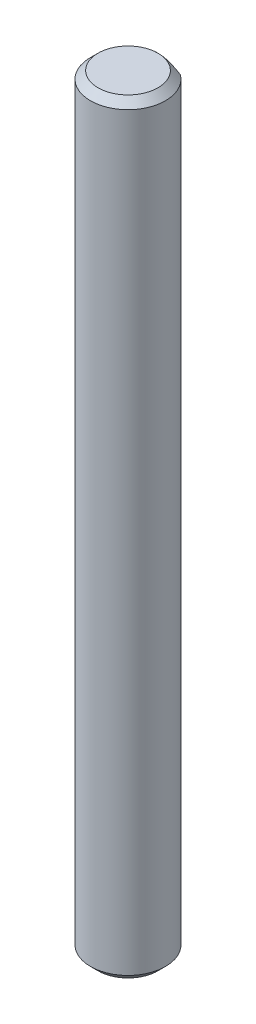
ISO-10303-21;
HEADER;
FILE_DESCRIPTION(('STEP AP214'),'2;1');
FILE_NAME('part.step','',(''),(''),'','','');
FILE_SCHEMA(('AUTOMOTIVE_DESIGN { 1 0 10303 214 1 1 1 1 }'));
ENDSEC;
DATA;
#1=APPLICATION_CONTEXT('core data for automotive mechanical design processes');
#2=APPLICATION_PROTOCOL_DEFINITION('international standard','automotive_design',2000,#1);
#3=PRODUCT_CONTEXT('',#1,'mechanical');
#4=PRODUCT('Part','Part','',(#3));
#5=PRODUCT_RELATED_PRODUCT_CATEGORY('part','',(#4));
#6=PRODUCT_DEFINITION_FORMATION('','',#4);
#7=PRODUCT_DEFINITION_CONTEXT('part definition',#1,'design');
#8=PRODUCT_DEFINITION('design','',#6,#7);
#9=PRODUCT_DEFINITION_SHAPE('','',#8);
#10=(LENGTH_UNIT() NAMED_UNIT(*) SI_UNIT(.MILLI.,.METRE.));
#11=(NAMED_UNIT(*) PLANE_ANGLE_UNIT() SI_UNIT($,.RADIAN.));
#12=(NAMED_UNIT(*) SI_UNIT($,.STERADIAN.) SOLID_ANGLE_UNIT());
#13=UNCERTAINTY_MEASURE_WITH_UNIT(LENGTH_MEASURE(1.E-05),#10,'distance_accuracy_value','');
#14=(GEOMETRIC_REPRESENTATION_CONTEXT(3) GLOBAL_UNCERTAINTY_ASSIGNED_CONTEXT((#13)) GLOBAL_UNIT_ASSIGNED_CONTEXT((#10,
#11,#12)) REPRESENTATION_CONTEXT('',''));
#15=CARTESIAN_POINT('',(0.,0.,0.));
#16=DIRECTION('',(0.,0.,1.));
#17=DIRECTION('',(1.,0.,0.));
#18=AXIS2_PLACEMENT_3D('',#15,#16,#17);
#19=CARTESIAN_POINT('',(0.,51.,0.));
#20=DIRECTION('',(0.,-1.,0.));
#21=DIRECTION('',(0.,0.,-1.));
#22=AXIS2_PLACEMENT_3D('',#19,#20,#21);
#23=CYLINDRICAL_SURFACE('',#22,2.5);
#24=CARTESIAN_POINT('',(0.,0.499999999999994,0.));
#25=DIRECTION('',(0.,1.,0.));
#26=DIRECTION('',(0.,0.,1.));
#27=AXIS2_PLACEMENT_3D('',#24,#25,#26);
#28=CIRCLE('',#27,2.5);
#29=CARTESIAN_POINT('',(0.,0.499999999999994,2.5));
#30=VERTEX_POINT('',#29);
#31=EDGE_CURVE('E86',#30,#30,#28,.T.);
#32=ORIENTED_EDGE('',*,*,#31,.T.);
#33=EDGE_LOOP('',(#32));
#34=FACE_BOUND('',#33,.T.);
#35=DIRECTION('',(0.,1.,0.));
#36=VECTOR('',#35,1.);
#37=CARTESIAN_POINT('',(1.5,36.,-2.));
#38=LINE('',#37,#36);
#39=CARTESIAN_POINT('',(1.5,36.,-2.));
#40=VERTEX_POINT('',#39);
#41=CARTESIAN_POINT('',(1.5,50.5,-2.));
#42=VERTEX_POINT('',#41);
#43=EDGE_CURVE('E79',#40,#42,#38,.T.);
#44=ORIENTED_EDGE('',*,*,#43,.T.);
#45=CARTESIAN_POINT('',(0.,50.5,0.));
#46=DIRECTION('',(0.,1.,0.));
#47=DIRECTION('',(0.,0.,1.));
#48=AXIS2_PLACEMENT_3D('',#45,#46,#47);
#49=CIRCLE('',#48,2.5);
#50=CARTESIAN_POINT('',(-1.5,50.5,-2.));
#51=VERTEX_POINT('',#50);
#52=EDGE_CURVE('E81',#42,#51,#49,.F.);
#53=ORIENTED_EDGE('',*,*,#52,.T.);
#54=DIRECTION('',(0.,1.,0.));
#55=VECTOR('',#54,1.);
#56=CARTESIAN_POINT('',(-1.5,36.,-2.));
#57=LINE('',#56,#55);
#58=CARTESIAN_POINT('',(-1.5,36.,-2.));
#59=VERTEX_POINT('',#58);
#60=EDGE_CURVE('E77',#59,#51,#57,.T.);
#61=ORIENTED_EDGE('',*,*,#60,.F.);
#62=CARTESIAN_POINT('',(0.,36.,0.));
#63=DIRECTION('',(0.,1.,0.));
#64=DIRECTION('',(0.,0.,1.));
#65=AXIS2_PLACEMENT_3D('',#62,#63,#64);
#66=CIRCLE('',#65,2.5);
#67=EDGE_CURVE('E68',#40,#59,#66,.T.);
#68=ORIENTED_EDGE('',*,*,#67,.F.);
#69=EDGE_LOOP('',(#44,#53,#61,#68));
#70=FACE_BOUND('',#69,.T.);
#71=ADVANCED_FACE('F34',(#34,#70),#23,.T.);
#72=CARTESIAN_POINT('',(0.,51.,0.));
#73=DIRECTION('',(0.,1.,0.));
#74=DIRECTION('',(0.,0.,1.));
#75=AXIS2_PLACEMENT_3D('',#72,#73,#74);
#76=PLANE('',#75);
#77=CARTESIAN_POINT('',(0.,51.,0.));
#78=DIRECTION('',(0.,1.,0.));
#79=DIRECTION('',(0.,0.,1.));
#80=AXIS2_PLACEMENT_3D('',#77,#78,#79);
#81=CIRCLE('',#80,1.99999999999999);
#82=CARTESIAN_POINT('',(0.,51.,-2.));
#83=VERTEX_POINT('',#82);
#84=EDGE_CURVE('E92',#83,#83,#81,.T.);
#85=ORIENTED_EDGE('',*,*,#84,.T.);
#86=EDGE_LOOP('',(#85));
#87=FACE_BOUND('',#86,.T.);
#88=ADVANCED_FACE('F102',(#87),#76,.T.);
#89=CARTESIAN_POINT('',(0.,0.,0.));
#90=DIRECTION('',(0.,1.,0.));
#91=DIRECTION('',(0.,0.,1.));
#92=AXIS2_PLACEMENT_3D('',#89,#90,#91);
#93=PLANE('',#92);
#94=CARTESIAN_POINT('',(0.,0.,0.));
#95=DIRECTION('',(0.,1.,0.));
#96=DIRECTION('',(0.,0.,1.));
#97=AXIS2_PLACEMENT_3D('',#94,#95,#96);
#98=CIRCLE('',#97,1.99999999999999);
#99=CARTESIAN_POINT('',(0.,0.,1.99999999999999));
#100=VERTEX_POINT('',#99);
#101=EDGE_CURVE('E89',#100,#100,#98,.F.);
#102=ORIENTED_EDGE('',*,*,#101,.T.);
#103=EDGE_LOOP('',(#102));
#104=FACE_BOUND('',#103,.T.);
#105=ADVANCED_FACE('F101',(#104),#93,.F.);
#106=CARTESIAN_POINT('',(-1.5,36.,-2.));
#107=DIRECTION('',(0.,0.,1.));
#108=DIRECTION('',(1.,0.,0.));
#109=AXIS2_PLACEMENT_3D('',#106,#107,#108);
#110=PLANE('',#109);
#111=CARTESIAN_POINT('',(-1.5,50.5,-2.));
#112=CARTESIAN_POINT('',(-1.42763018659214,50.5433736980276,-2.));
#113=CARTESIAN_POINT('',(-1.35436226532258,50.5853687019536,-2.));
#114=CARTESIAN_POINT('',(-1.20549660628809,50.6656443583189,-2.));
#115=CARTESIAN_POINT('',(-1.12989157710705,50.7039114197061,-2.));
#116=CARTESIAN_POINT('',(-0.978296734874827,50.774534191742,-2.));
#117=CARTESIAN_POINT('',(-0.902366736266404,50.8070165390548,-2.));
#118=CARTESIAN_POINT('',(-0.748220644904071,50.8658090166989,-2.));
#119=CARTESIAN_POINT('',(-0.670007876047703,50.8921276624893,-2.));
#120=CARTESIAN_POINT('',(-0.543060600019242,50.9280861032667,-2.));
#121=CARTESIAN_POINT('',(-0.495021163503639,50.9401901027996,-2.));
#122=CARTESIAN_POINT('',(-0.398260419217579,50.9612794306282,-2.));
#123=CARTESIAN_POINT('',(-0.349539198139852,50.9702651517484,-2.));
#124=CARTESIAN_POINT('',(-0.250852177401956,50.984927124024,-2.));
#125=CARTESIAN_POINT('',(-0.200878654038627,50.9905520018212,-2.));
#126=CARTESIAN_POINT('',(-0.100607619276169,50.9981023484678,-2.));
#127=CARTESIAN_POINT('',(-0.0503098472705245,51.0000243314446,-2.));
#128=CARTESIAN_POINT('',(0.,51.,-2.));
#129=B_SPLINE_CURVE_WITH_KNOTS('',3,(#111,#112,#113,#114,#115,#116,#117,#118,#119,#120,#121,
#122,#123,#124,#125,#126,#127,#128),.UNSPECIFIED.,.F.,.F.,(4,2,2,2,2,2,2,2,4),(0.,
0.2531950346956,0.50728107597429,0.754837752612878,1.00205037282501,1.15058504578388,
1.29910100031797,1.44983263801686,1.600706103947),.UNSPECIFIED.);
#130=EDGE_CURVE('E47',#51,#83,#129,.T.);
#131=ORIENTED_EDGE('',*,*,#130,.T.);
#132=CARTESIAN_POINT('',(0.,51.,-1.99999999999999));
#133=CARTESIAN_POINT('',(0.0614966481035616,51.0000514930087,-2.));
#134=CARTESIAN_POINT('',(0.122961796118779,50.997164788165,-2.));
#135=CARTESIAN_POINT('',(0.245274670057057,50.9859212389057,-2.));
#136=CARTESIAN_POINT('',(0.306123362775477,50.9775750221521,-2.));
#137=CARTESIAN_POINT('',(0.425885509906891,50.9559969816614,-2.));
#138=CARTESIAN_POINT('',(0.484814317272308,50.9428488248966,-2.));
#139=CARTESIAN_POINT('',(0.601555526074533,50.9122507618696,-2.));
#140=CARTESIAN_POINT('',(0.659367456410754,50.8947990813251,-2.));
#141=CARTESIAN_POINT('',(0.784576263433312,50.8525702057821,-2.));
#142=CARTESIAN_POINT('',(0.851714510760655,50.8270315815753,-2.));
#143=CARTESIAN_POINT('',(0.984250024576912,50.7717452055524,-2.));
#144=CARTESIAN_POINT('',(1.04964642506795,50.7419954048129,-2.));
#145=CARTESIAN_POINT('',(1.18016546542206,50.6784785026746,-2.));
#146=CARTESIAN_POINT('',(1.24525271545219,50.6446394298057,-2.));
#147=CARTESIAN_POINT('',(1.37378197006118,50.5742160914667,-2.));
#148=CARTESIAN_POINT('',(1.43722666174302,50.5376367483736,-2.));
#149=CARTESIAN_POINT('',(1.5,50.5,-2.));
#150=B_SPLINE_CURVE_WITH_KNOTS('',3,(#132,#133,#134,#135,#136,#137,#138,#139,#140,#141,#142,
#143,#144,#145,#146,#147,#148,#149),.UNSPECIFIED.,.F.,.F.,(4,2,2,2,2,2,2,2,4),(0.,
0.184371949240824,0.368386057907036,0.549336051664293,0.730360773654886,0.94567404487139,
1.16109243790835,1.38109142427279,1.60070428639642),.UNSPECIFIED.);
#151=EDGE_CURVE('E11',#83,#42,#150,.T.);
#152=ORIENTED_EDGE('',*,*,#151,.T.);
#153=ORIENTED_EDGE('',*,*,#43,.F.);
#154=DIRECTION('',(1.,0.,0.));
#155=VECTOR('',#154,1.);
#156=CARTESIAN_POINT('',(-1.5,36.,-2.));
#157=LINE('',#156,#155);
#158=EDGE_CURVE('E71',#59,#40,#157,.T.);
#159=ORIENTED_EDGE('',*,*,#158,.F.);
#160=ORIENTED_EDGE('',*,*,#60,.T.);
#161=EDGE_LOOP('',(#131,#152,#153,#159,#160));
#162=FACE_BOUND('',#161,.T.);
#163=ADVANCED_FACE('F76',(#162),#110,.F.);
#164=CARTESIAN_POINT('',(0.,36.,0.));
#165=DIRECTION('',(0.,1.,0.));
#166=DIRECTION('',(0.,0.,1.));
#167=AXIS2_PLACEMENT_3D('',#164,#165,#166);
#168=PLANE('',#167);
#169=ORIENTED_EDGE('',*,*,#67,.T.);
#170=ORIENTED_EDGE('',*,*,#158,.T.);
#171=EDGE_LOOP('',(#169,#170));
#172=FACE_BOUND('',#171,.T.);
#173=ADVANCED_FACE('F70',(#172),#168,.T.);
#174=CARTESIAN_POINT('',(0.,0.499999999999994,0.));
#175=DIRECTION('',(0.,1.,0.));
#176=DIRECTION('',(0.,0.,1.));
#177=AXIS2_PLACEMENT_3D('',#174,#175,#176);
#178=CONICAL_SURFACE('',#177,2.5,0.78539816339746);
#179=ORIENTED_EDGE('',*,*,#101,.F.);
#180=EDGE_LOOP('',(#179));
#181=FACE_BOUND('',#180,.T.);
#182=ORIENTED_EDGE('',*,*,#31,.F.);
#183=EDGE_LOOP('',(#182));
#184=FACE_BOUND('',#183,.T.);
#185=ADVANCED_FACE('F112',(#181,#184),#178,.T.);
#186=CARTESIAN_POINT('',(0.,51.,0.));
#187=DIRECTION('',(0.,-1.,0.));
#188=DIRECTION('',(0.,0.,-1.));
#189=AXIS2_PLACEMENT_3D('',#186,#187,#188);
#190=CONICAL_SURFACE('',#189,1.99999999999999,0.785398163397446);
#191=ORIENTED_EDGE('',*,*,#130,.F.);
#192=ORIENTED_EDGE('',*,*,#52,.F.);
#193=ORIENTED_EDGE('',*,*,#151,.F.);
#194=ORIENTED_EDGE('',*,*,#84,.F.);
#195=EDGE_LOOP('',(#191,#192,#193,#194));
#196=FACE_BOUND('',#195,.T.);
#197=ADVANCED_FACE('F36',(#196),#190,.T.);
#198=CLOSED_SHELL('',(#71,#88,#105,#163,#173,#185,#197));
#199=MANIFOLD_SOLID_BREP('B2',#198);
#200=ADVANCED_BREP_SHAPE_REPRESENTATION('',(#18,#199),#14);
#201=SHAPE_DEFINITION_REPRESENTATION(#9,#200);
ENDSEC;
END-ISO-10303-21;
